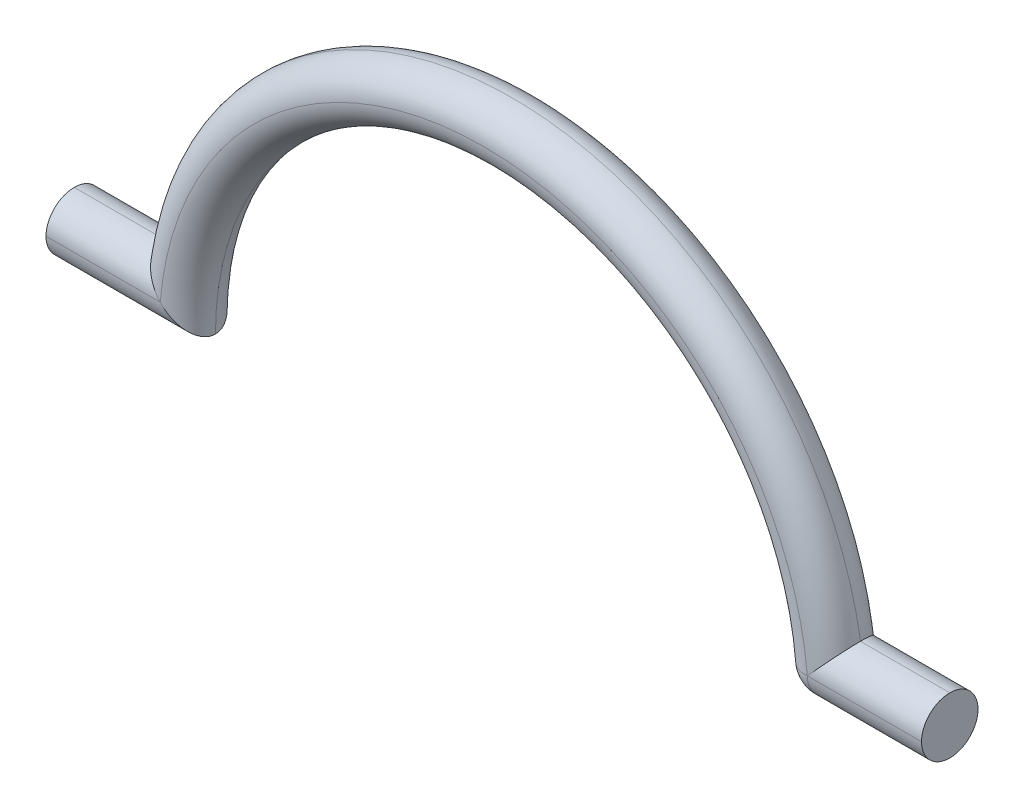
ISO-10303-21;
HEADER;
FILE_DESCRIPTION(('STEP AP214'),'2;1');
FILE_NAME('part.step','',(''),(''),'','','');
FILE_SCHEMA(('AUTOMOTIVE_DESIGN { 1 0 10303 214 1 1 1 1 }'));
ENDSEC;
DATA;
#1=APPLICATION_CONTEXT('core data for automotive mechanical design processes');
#2=APPLICATION_PROTOCOL_DEFINITION('international standard','automotive_design',2000,#1);
#3=PRODUCT_CONTEXT('',#1,'mechanical');
#4=PRODUCT('Part','Part','',(#3));
#5=PRODUCT_RELATED_PRODUCT_CATEGORY('part','',(#4));
#6=PRODUCT_DEFINITION_FORMATION('','',#4);
#7=PRODUCT_DEFINITION_CONTEXT('part definition',#1,'design');
#8=PRODUCT_DEFINITION('design','',#6,#7);
#9=PRODUCT_DEFINITION_SHAPE('','',#8);
#10=(LENGTH_UNIT() NAMED_UNIT(*) SI_UNIT(.MILLI.,.METRE.));
#11=(NAMED_UNIT(*) PLANE_ANGLE_UNIT() SI_UNIT($,.RADIAN.));
#12=(NAMED_UNIT(*) SI_UNIT($,.STERADIAN.) SOLID_ANGLE_UNIT());
#13=UNCERTAINTY_MEASURE_WITH_UNIT(LENGTH_MEASURE(1.E-05),#10,'distance_accuracy_value','');
#14=(GEOMETRIC_REPRESENTATION_CONTEXT(3) GLOBAL_UNCERTAINTY_ASSIGNED_CONTEXT((#13)) GLOBAL_UNIT_ASSIGNED_CONTEXT((#10,
#11,#12)) REPRESENTATION_CONTEXT('',''));
#15=CARTESIAN_POINT('',(0.,0.,0.));
#16=DIRECTION('',(0.,0.,1.));
#17=DIRECTION('',(1.,0.,0.));
#18=AXIS2_PLACEMENT_3D('',#15,#16,#17);
#19=CARTESIAN_POINT('',(15.5,0.,2.));
#20=DIRECTION('',(-1.,0.,0.));
#21=DIRECTION('',(0.,0.,1.));
#22=AXIS2_PLACEMENT_3D('',#19,#20,#21);
#23=PLANE('',#22);
#24=CARTESIAN_POINT('',(15.5,1.,1.));
#25=DIRECTION('',(-1.,0.,0.));
#26=DIRECTION('',(0.,0.,1.));
#27=AXIS2_PLACEMENT_3D('',#24,#25,#26);
#28=CIRCLE('',#27,1.);
#29=CARTESIAN_POINT('',(15.5,1.,2.));
#30=VERTEX_POINT('',#29);
#31=CARTESIAN_POINT('',(15.5,0.,1.));
#32=VERTEX_POINT('',#31);
#33=EDGE_CURVE('E209',#30,#32,#28,.F.);
#34=ORIENTED_EDGE('',*,*,#33,.T.);
#35=CARTESIAN_POINT('',(15.5,1.,1.));
#36=DIRECTION('',(-1.,0.,0.));
#37=DIRECTION('',(0.,0.,1.));
#38=AXIS2_PLACEMENT_3D('',#35,#36,#37);
#39=CIRCLE('',#38,1.);
#40=CARTESIAN_POINT('',(15.5,0.999999999999999,0.));
#41=VERTEX_POINT('',#40);
#42=EDGE_CURVE('E11',#32,#41,#39,.F.);
#43=ORIENTED_EDGE('',*,*,#42,.T.);
#44=CARTESIAN_POINT('',(15.5,0.999999999999999,1.));
#45=DIRECTION('',(-1.,0.,0.));
#46=DIRECTION('',(0.,0.,1.));
#47=AXIS2_PLACEMENT_3D('',#44,#45,#46);
#48=CIRCLE('',#47,1.);
#49=CARTESIAN_POINT('',(15.5,2.,1.));
#50=VERTEX_POINT('',#49);
#51=EDGE_CURVE('E218',#41,#50,#48,.F.);
#52=ORIENTED_EDGE('',*,*,#51,.T.);
#53=CARTESIAN_POINT('',(15.5,0.999999999999999,1.));
#54=DIRECTION('',(-1.,0.,0.));
#55=DIRECTION('',(0.,0.,1.));
#56=AXIS2_PLACEMENT_3D('',#53,#54,#55);
#57=CIRCLE('',#56,1.);
#58=EDGE_CURVE('E181',#50,#30,#57,.F.);
#59=ORIENTED_EDGE('',*,*,#58,.T.);
#60=EDGE_LOOP('',(#34,#43,#52,#59));
#61=FACE_BOUND('',#60,.T.);
#62=ADVANCED_FACE('F42',(#61),#23,.F.);
#63=CARTESIAN_POINT('',(-15.5,0.,2.));
#64=DIRECTION('',(1.,0.,0.));
#65=DIRECTION('',(0.,0.,-1.));
#66=AXIS2_PLACEMENT_3D('',#63,#64,#65);
#67=PLANE('',#66);
#68=CARTESIAN_POINT('',(-15.5,0.999999999999998,1.));
#69=DIRECTION('',(1.,0.,0.));
#70=DIRECTION('',(0.,0.,-1.));
#71=AXIS2_PLACEMENT_3D('',#68,#69,#70);
#72=CIRCLE('',#71,1.);
#73=CARTESIAN_POINT('',(-15.5,1.,0.));
#74=VERTEX_POINT('',#73);
#75=CARTESIAN_POINT('',(-15.5,0.,1.));
#76=VERTEX_POINT('',#75);
#77=EDGE_CURVE('E119',#74,#76,#72,.F.);
#78=ORIENTED_EDGE('',*,*,#77,.T.);
#79=CARTESIAN_POINT('',(-15.5,0.999999999999998,1.));
#80=DIRECTION('',(1.,0.,0.));
#81=DIRECTION('',(0.,0.,-1.));
#82=AXIS2_PLACEMENT_3D('',#79,#80,#81);
#83=CIRCLE('',#82,1.);
#84=CARTESIAN_POINT('',(-15.5,1.,2.));
#85=VERTEX_POINT('',#84);
#86=EDGE_CURVE('E113',#76,#85,#83,.F.);
#87=ORIENTED_EDGE('',*,*,#86,.T.);
#88=CARTESIAN_POINT('',(-15.5,1.,1.));
#89=DIRECTION('',(1.,0.,0.));
#90=DIRECTION('',(0.,0.,-1.));
#91=AXIS2_PLACEMENT_3D('',#88,#89,#90);
#92=CIRCLE('',#91,1.);
#93=CARTESIAN_POINT('',(-15.5,2.,1.));
#94=VERTEX_POINT('',#93);
#95=EDGE_CURVE('E116',#85,#94,#92,.F.);
#96=ORIENTED_EDGE('',*,*,#95,.T.);
#97=CARTESIAN_POINT('',(-15.5,1.,1.));
#98=DIRECTION('',(1.,0.,0.));
#99=DIRECTION('',(0.,0.,-1.));
#100=AXIS2_PLACEMENT_3D('',#97,#98,#99);
#101=CIRCLE('',#100,1.);
#102=EDGE_CURVE('E223',#94,#74,#101,.F.);
#103=ORIENTED_EDGE('',*,*,#102,.T.);
#104=EDGE_LOOP('',(#78,#87,#96,#103));
#105=FACE_BOUND('',#104,.T.);
#106=ADVANCED_FACE('F115',(#105),#67,.F.);
#107=CARTESIAN_POINT('',(0.,0.999999999999997,1.));
#108=DIRECTION('',(1.,0.,0.));
#109=DIRECTION('',(0.,1.,0.));
#110=AXIS2_PLACEMENT_3D('',#107,#108,#109);
#111=CYLINDRICAL_SURFACE('',#110,1.);
#112=ORIENTED_EDGE('',*,*,#95,.F.);
#113=DIRECTION('',(-1.,0.,0.));
#114=VECTOR('',#113,1.);
#115=CARTESIAN_POINT('',(-15.5,1.,2.));
#116=LINE('',#115,#114);
#117=CARTESIAN_POINT('',(-11.4564392373896,0.999999999999999,2.));
#118=VERTEX_POINT('',#117);
#119=EDGE_CURVE('E130',#118,#85,#116,.T.);
#120=ORIENTED_EDGE('',*,*,#119,.F.);
#121=CARTESIAN_POINT('',(-12.3389626792531,2.,1.));
#122=CARTESIAN_POINT('',(-12.3389646351975,2.0000025284695,1.02337388491235));
#123=CARTESIAN_POINT('',(-12.3382647375702,1.99917980040269,1.04673437253085));
#124=CARTESIAN_POINT('',(-12.3354865951296,1.99591555259792,1.09324610211119));
#125=CARTESIAN_POINT('',(-12.3334091534739,1.99347497612394,1.11639745803661));
#126=CARTESIAN_POINT('',(-12.3251899947964,1.98382271804957,1.18494902878899));
#127=CARTESIAN_POINT('',(-12.3170605383304,1.97427938785814,1.22981439000783));
#128=CARTESIAN_POINT('',(-12.2960190988534,1.94961797445727,1.31664596908342));
#129=CARTESIAN_POINT('',(-12.2831163406165,1.93451064435613,1.35861759490206));
#130=CARTESIAN_POINT('',(-12.2531944953151,1.89955005652493,1.4390172568087));
#131=CARTESIAN_POINT('',(-12.2361681921303,1.87968847967599,1.47743891587613));
#132=CARTESIAN_POINT('',(-12.1925600055079,1.82894784449291,1.56215484659433));
#133=CARTESIAN_POINT('',(-12.1646760021647,1.7965922796443,1.60689399893066));
#134=CARTESIAN_POINT('',(-12.1043945773746,1.72692645312189,1.68882614943616));
#135=CARTESIAN_POINT('',(-12.0719898117975,1.68960813399584,1.72600662179481));
#136=CARTESIAN_POINT('',(-11.9933776784451,1.59948250258567,1.80320733304777));
#137=CARTESIAN_POINT('',(-11.9459912790239,1.54544246113355,1.84058124905794));
#138=CARTESIAN_POINT('',(-11.8475307157728,1.43388346455975,1.90324234998775));
#139=CARTESIAN_POINT('',(-11.7964529369449,1.37636110837564,1.92851749669816));
#140=CARTESIAN_POINT('',(-11.6982151151231,1.26648151950925,1.96536904140237));
#141=CARTESIAN_POINT('',(-11.6513027828114,1.21431449970496,1.97820881508069));
#142=CARTESIAN_POINT('',(-11.5565411963398,1.10959078933064,1.9953882519191));
#143=CARTESIAN_POINT('',(-11.5086939586068,1.05703506283623,1.99974452477709));
#144=CARTESIAN_POINT('',(-11.4592933163264,1.0031143447076,1.99999636116849));
#145=CARTESIAN_POINT('',(-11.4578663277403,1.00155708147522,1.99999999777978));
#146=CARTESIAN_POINT('',(-11.4564392373896,0.999999999999999,2.));
#147=B_SPLINE_CURVE_WITH_KNOTS('',3,(#121,#122,#123,#124,#125,#126,#127,#128,#129,#130,#131,
#132,#133,#134,#135,#136,#137,#138,#139,#140,#141,#142,#143,#144,#145,#146),.UNSPECIFIED.,.F.,
.F.,(4,2,2,2,2,2,2,2,2,2,2,2,4),(0.,0.0700710735051621,0.140101328936832,0.279075258052492,
0.417782000541511,0.556733253595767,0.74129081120055,0.92615175779909,1.16789347977333,
1.40987523602553,1.62333896969062,1.83638434458721,1.84272092183685),.UNSPECIFIED.);
#148=CARTESIAN_POINT('',(-12.3389626792531,2.,1.));
#149=VERTEX_POINT('',#148);
#150=EDGE_CURVE('E142',#149,#118,#147,.T.);
#151=ORIENTED_EDGE('',*,*,#150,.F.);
#152=DIRECTION('',(-1.,0.,0.));
#153=VECTOR('',#152,1.);
#154=CARTESIAN_POINT('',(-12.3389626792531,2.,1.));
#155=LINE('',#154,#153);
#156=EDGE_CURVE('E133',#94,#149,#155,.F.);
#157=ORIENTED_EDGE('',*,*,#156,.F.);
#158=EDGE_LOOP('',(#112,#120,#151,#157));
#159=FACE_BOUND('',#158,.T.);
#160=ADVANCED_FACE('F128',(#159),#111,.T.);
#161=CARTESIAN_POINT('',(0.,0.,1.));
#162=DIRECTION('',(0.,0.,1.));
#163=DIRECTION('',(1.,0.,0.));
#164=AXIS2_PLACEMENT_3D('',#161,#162,#163);
#165=TOROIDAL_SURFACE('',#164,11.5,1.);
#166=CARTESIAN_POINT('',(0.,0.,2.));
#167=DIRECTION('',(0.,0.,1.));
#168=DIRECTION('',(1.,0.,0.));
#169=AXIS2_PLACEMENT_3D('',#166,#167,#168);
#170=CIRCLE('',#169,11.5);
#171=CARTESIAN_POINT('',(11.4564392373896,0.999999999999999,2.));
#172=VERTEX_POINT('',#171);
#173=EDGE_CURVE('E141',#172,#118,#170,.T.);
#174=ORIENTED_EDGE('',*,*,#173,.F.);
#175=CARTESIAN_POINT('',(12.3389626792531,2.,1.));
#176=CARTESIAN_POINT('',(12.3389646351975,2.0000025284695,1.02337388491235));
#177=CARTESIAN_POINT('',(12.3382647375702,1.99917980040269,1.04673437253085));
#178=CARTESIAN_POINT('',(12.3354865951296,1.99591555259792,1.09324610211119));
#179=CARTESIAN_POINT('',(12.3334091534739,1.99347497612394,1.11639745803661));
#180=CARTESIAN_POINT('',(12.3251899947964,1.98382271804957,1.18494902878899));
#181=CARTESIAN_POINT('',(12.3170605383304,1.97427938785814,1.22981439000783));
#182=CARTESIAN_POINT('',(12.2960190988534,1.94961797445727,1.31664596908342));
#183=CARTESIAN_POINT('',(12.2831163406165,1.93451064435613,1.35861759490206));
#184=CARTESIAN_POINT('',(12.2531944953151,1.89955005652493,1.4390172568087));
#185=CARTESIAN_POINT('',(12.2361681921303,1.87968847967599,1.47743891587613));
#186=CARTESIAN_POINT('',(12.1925600055079,1.82894784449291,1.56215484659433));
#187=CARTESIAN_POINT('',(12.1646760021647,1.7965922796443,1.60689399893066));
#188=CARTESIAN_POINT('',(12.1043945773746,1.72692645312189,1.68882614943616));
#189=CARTESIAN_POINT('',(12.0719898117975,1.68960813399584,1.72600662179481));
#190=CARTESIAN_POINT('',(11.9933776784451,1.59948250258567,1.80320733304777));
#191=CARTESIAN_POINT('',(11.9459912790239,1.54544246113355,1.84058124905794));
#192=CARTESIAN_POINT('',(11.8475307157728,1.43388346455975,1.90324234998775));
#193=CARTESIAN_POINT('',(11.7964529369449,1.37636110837564,1.92851749669816));
#194=CARTESIAN_POINT('',(11.6982151151231,1.26648151950925,1.96536904140237));
#195=CARTESIAN_POINT('',(11.6513027828114,1.21431449970496,1.97820881508069));
#196=CARTESIAN_POINT('',(11.5565411963398,1.10959078933064,1.9953882519191));
#197=CARTESIAN_POINT('',(11.5086939586068,1.05703506283623,1.99974452477709));
#198=CARTESIAN_POINT('',(11.4592933163264,1.0031143447076,1.99999636116849));
#199=CARTESIAN_POINT('',(11.4578663277403,1.00155708147522,1.99999999777978));
#200=CARTESIAN_POINT('',(11.4564392373896,0.999999999999999,2.));
#201=B_SPLINE_CURVE_WITH_KNOTS('',3,(#175,#176,#177,#178,#179,#180,#181,#182,#183,#184,#185,
#186,#187,#188,#189,#190,#191,#192,#193,#194,#195,#196,#197,#198,#199,#200),.UNSPECIFIED.,.F.,
.F.,(4,2,2,2,2,2,2,2,2,2,2,2,4),(0.,0.0700710735051621,0.140101328936832,0.279075258052492,
0.417782000541511,0.556733253595767,0.74129081120055,0.92615175779909,1.16789347977334,
1.40987523602553,1.62333896969062,1.83638434458721,1.84272092183685),.UNSPECIFIED.);
#202=CARTESIAN_POINT('',(12.3389626792531,2.,1.));
#203=VERTEX_POINT('',#202);
#204=EDGE_CURVE('E172',#172,#203,#201,.F.);
#205=ORIENTED_EDGE('',*,*,#204,.T.);
#206=CARTESIAN_POINT('',(0.,0.,1.));
#207=DIRECTION('',(0.,0.,1.));
#208=DIRECTION('',(1.,0.,0.));
#209=AXIS2_PLACEMENT_3D('',#206,#207,#208);
#210=CIRCLE('',#209,12.5);
#211=EDGE_CURVE('E135',#149,#203,#210,.F.);
#212=ORIENTED_EDGE('',*,*,#211,.F.);
#213=ORIENTED_EDGE('',*,*,#150,.T.);
#214=EDGE_LOOP('',(#174,#205,#212,#213));
#215=FACE_BOUND('',#214,.T.);
#216=ADVANCED_FACE('F161',(#215),#165,.T.);
#217=CARTESIAN_POINT('',(15.5,0.999999999999999,1.));
#218=DIRECTION('',(-1.,0.,0.));
#219=DIRECTION('',(0.,0.,1.));
#220=AXIS2_PLACEMENT_3D('',#217,#218,#219);
#221=CYLINDRICAL_SURFACE('',#220,1.);
#222=ORIENTED_EDGE('',*,*,#51,.F.);
#223=DIRECTION('',(-1.,0.,0.));
#224=VECTOR('',#223,1.);
#225=CARTESIAN_POINT('',(0.,0.999999999999999,0.));
#226=LINE('',#225,#224);
#227=CARTESIAN_POINT('',(11.4564392373896,0.999999999999999,0.));
#228=VERTEX_POINT('',#227);
#229=EDGE_CURVE('E124',#228,#41,#226,.F.);
#230=ORIENTED_EDGE('',*,*,#229,.F.);
#231=CARTESIAN_POINT('',(12.3389626792531,2.,1.));
#232=CARTESIAN_POINT('',(12.3389646351975,2.0000025284695,0.976626115087649));
#233=CARTESIAN_POINT('',(12.3382647375702,1.99917980040269,0.95326562746915));
#234=CARTESIAN_POINT('',(12.3354865951296,1.99591555259792,0.906753897888809));
#235=CARTESIAN_POINT('',(12.3334091534739,1.99347497612394,0.883602541963386));
#236=CARTESIAN_POINT('',(12.3251899947964,1.98382271804957,0.81505097121101));
#237=CARTESIAN_POINT('',(12.3170605383304,1.97427938785814,0.770185609992169));
#238=CARTESIAN_POINT('',(12.2960190988534,1.94961797445727,0.683354030916584));
#239=CARTESIAN_POINT('',(12.2831163406165,1.93451064435613,0.641382405097939));
#240=CARTESIAN_POINT('',(12.2531944953151,1.89955005652493,0.560982743191299));
#241=CARTESIAN_POINT('',(12.2361681921303,1.87968847967599,0.522561084123867));
#242=CARTESIAN_POINT('',(12.1925600055079,1.82894784449291,0.43784515340567));
#243=CARTESIAN_POINT('',(12.1646760021647,1.7965922796443,0.39310600106934));
#244=CARTESIAN_POINT('',(12.1043945773746,1.72692645312189,0.311173850563844));
#245=CARTESIAN_POINT('',(12.0719898117975,1.68960813399584,0.273993378205194));
#246=CARTESIAN_POINT('',(11.9933776784451,1.59948250258567,0.19679266695223));
#247=CARTESIAN_POINT('',(11.9459912790239,1.54544246113355,0.15941875094206));
#248=CARTESIAN_POINT('',(11.8475307157728,1.43388346455975,0.0967576500122516));
#249=CARTESIAN_POINT('',(11.7964529369449,1.37636110837564,0.0714825033018401));
#250=CARTESIAN_POINT('',(11.6982151151231,1.26648151950925,0.0346309585976325));
#251=CARTESIAN_POINT('',(11.6513027828114,1.21431449970495,0.0217911849193081));
#252=CARTESIAN_POINT('',(11.5565411963398,1.10959078933065,0.00461174808089598));
#253=CARTESIAN_POINT('',(11.5086939586068,1.05703506283624,0.000255475222908989));
#254=CARTESIAN_POINT('',(11.4592933163264,1.0031143447076,3.6388315121597E-06));
#255=CARTESIAN_POINT('',(11.4578663277403,1.00155708147522,2.22022127127157E-09));
#256=CARTESIAN_POINT('',(11.4564392373896,0.999999999999999,0.));
#257=B_SPLINE_CURVE_WITH_KNOTS('',3,(#231,#232,#233,#234,#235,#236,#237,#238,#239,#240,#241,
#242,#243,#244,#245,#246,#247,#248,#249,#250,#251,#252,#253,#254,#255,#256),.UNSPECIFIED.,.F.,
.F.,(4,2,2,2,2,2,2,2,2,2,2,2,4),(0.,0.0700710735051621,0.140101328936832,0.279075258052492,
0.417782000541511,0.556733253595767,0.741290811200551,0.926151757799091,1.16789347977334,
1.40987523602553,1.62333896969062,1.83638434458721,1.84272092183685),.UNSPECIFIED.);
#258=EDGE_CURVE('E145',#203,#228,#257,.T.);
#259=ORIENTED_EDGE('',*,*,#258,.F.);
#260=DIRECTION('',(-1.,0.,0.));
#261=VECTOR('',#260,1.);
#262=CARTESIAN_POINT('',(15.5,2.,1.));
#263=LINE('',#262,#261);
#264=EDGE_CURVE('E229',#50,#203,#263,.T.);
#265=ORIENTED_EDGE('',*,*,#264,.F.);
#266=EDGE_LOOP('',(#222,#230,#259,#265));
#267=FACE_BOUND('',#266,.T.);
#268=ADVANCED_FACE('F165',(#267),#221,.T.);
#269=CARTESIAN_POINT('',(-15.5,1.,1.));
#270=DIRECTION('',(-1.,0.,0.));
#271=DIRECTION('',(0.,-1.,0.));
#272=AXIS2_PLACEMENT_3D('',#269,#270,#271);
#273=CYLINDRICAL_SURFACE('',#272,1.);
#274=ORIENTED_EDGE('',*,*,#102,.F.);
#275=ORIENTED_EDGE('',*,*,#156,.T.);
#276=CARTESIAN_POINT('',(-12.3389626792531,2.,1.));
#277=CARTESIAN_POINT('',(-12.3389646351975,2.0000025284695,0.97662611508765));
#278=CARTESIAN_POINT('',(-12.3382647375702,1.99917980040269,0.95326562746915));
#279=CARTESIAN_POINT('',(-12.3354865951296,1.99591555259792,0.906753897888809));
#280=CARTESIAN_POINT('',(-12.3334091534739,1.99347497612394,0.883602541963386));
#281=CARTESIAN_POINT('',(-12.3251899947964,1.98382271804957,0.81505097121101));
#282=CARTESIAN_POINT('',(-12.3170605383304,1.97427938785814,0.770185609992169));
#283=CARTESIAN_POINT('',(-12.2960190988534,1.94961797445727,0.683354030916584));
#284=CARTESIAN_POINT('',(-12.2831163406165,1.93451064435613,0.641382405097939));
#285=CARTESIAN_POINT('',(-12.2531944953151,1.89955005652493,0.560982743191299));
#286=CARTESIAN_POINT('',(-12.2361681921303,1.87968847967599,0.522561084123867));
#287=CARTESIAN_POINT('',(-12.1925600055079,1.82894784449291,0.43784515340567));
#288=CARTESIAN_POINT('',(-12.1646760021647,1.7965922796443,0.393106001069341));
#289=CARTESIAN_POINT('',(-12.1043945773746,1.72692645312189,0.311173850563844));
#290=CARTESIAN_POINT('',(-12.0719898117975,1.68960813399584,0.273993378205194));
#291=CARTESIAN_POINT('',(-11.9933776784451,1.59948250258567,0.19679266695223));
#292=CARTESIAN_POINT('',(-11.9459912790239,1.54544246113355,0.15941875094206));
#293=CARTESIAN_POINT('',(-11.8475307157728,1.43388346455975,0.0967576500122516));
#294=CARTESIAN_POINT('',(-11.7964529369449,1.37636110837564,0.0714825033018399));
#295=CARTESIAN_POINT('',(-11.6982151151231,1.26648151950925,0.0346309585976325));
#296=CARTESIAN_POINT('',(-11.6513027828114,1.21431449970495,0.0217911849193084));
#297=CARTESIAN_POINT('',(-11.5565411963398,1.10959078933065,0.00461174808089564));
#298=CARTESIAN_POINT('',(-11.5086939586068,1.05703506283624,0.000255475222907734));
#299=CARTESIAN_POINT('',(-11.4592933163264,1.0031143447076,3.63883151208555E-06));
#300=CARTESIAN_POINT('',(-11.4578663277403,1.00155708147522,2.22022123306401E-09));
#301=CARTESIAN_POINT('',(-11.4564392373896,0.999999999999999,0.));
#302=B_SPLINE_CURVE_WITH_KNOTS('',3,(#276,#277,#278,#279,#280,#281,#282,#283,#284,#285,#286,
#287,#288,#289,#290,#291,#292,#293,#294,#295,#296,#297,#298,#299,#300,#301),.UNSPECIFIED.,.F.,
.F.,(4,2,2,2,2,2,2,2,2,2,2,2,4),(0.,0.0700710735051619,0.140101328936831,0.279075258052492,
0.417782000541511,0.556733253595767,0.741290811200551,0.926151757799091,1.16789347977334,
1.40987523602553,1.62333896969062,1.83638434458721,1.84272092183685),.UNSPECIFIED.);
#303=CARTESIAN_POINT('',(-11.4564392373896,1.,0.));
#304=VERTEX_POINT('',#303);
#305=EDGE_CURVE('E267',#304,#149,#302,.F.);
#306=ORIENTED_EDGE('',*,*,#305,.F.);
#307=DIRECTION('',(-1.,0.,0.));
#308=VECTOR('',#307,1.);
#309=CARTESIAN_POINT('',(0.,0.999999999999997,0.));
#310=LINE('',#309,#308);
#311=EDGE_CURVE('E264',#74,#304,#310,.F.);
#312=ORIENTED_EDGE('',*,*,#311,.F.);
#313=EDGE_LOOP('',(#274,#275,#306,#312));
#314=FACE_BOUND('',#313,.T.);
#315=ADVANCED_FACE('F279',(#314),#273,.T.);
#316=CARTESIAN_POINT('',(0.,0.,1.));
#317=DIRECTION('',(0.,0.,1.));
#318=DIRECTION('',(1.,0.,0.));
#319=AXIS2_PLACEMENT_3D('',#316,#317,#318);
#320=TOROIDAL_SURFACE('',#319,11.5,1.);
#321=ORIENTED_EDGE('',*,*,#211,.T.);
#322=ORIENTED_EDGE('',*,*,#258,.T.);
#323=CARTESIAN_POINT('',(0.,0.,0.));
#324=DIRECTION('',(0.,0.,1.));
#325=DIRECTION('',(1.,0.,0.));
#326=AXIS2_PLACEMENT_3D('',#323,#324,#325);
#327=CIRCLE('',#326,11.5);
#328=EDGE_CURVE('E261',#304,#228,#327,.F.);
#329=ORIENTED_EDGE('',*,*,#328,.F.);
#330=ORIENTED_EDGE('',*,*,#305,.T.);
#331=EDGE_LOOP('',(#321,#322,#329,#330));
#332=FACE_BOUND('',#331,.T.);
#333=ADVANCED_FACE('F277',(#332),#320,.T.);
#334=CARTESIAN_POINT('',(-12.5,1.,1.));
#335=DIRECTION('',(1.,0.,0.));
#336=DIRECTION('',(0.,1.,0.));
#337=AXIS2_PLACEMENT_3D('',#334,#335,#336);
#338=CYLINDRICAL_SURFACE('',#337,1.);
#339=ORIENTED_EDGE('',*,*,#77,.F.);
#340=ORIENTED_EDGE('',*,*,#311,.T.);
#341=CARTESIAN_POINT('',(-10.5,0.,1.));
#342=CARTESIAN_POINT('',(-10.4999966251875,-3.09805134946097E-06,0.977476641487929));
#343=CARTESIAN_POINT('',(-10.5007616337562,0.000761611478248969,0.954967355052061));
#344=CARTESIAN_POINT('',(-10.5037900687932,0.00379058430058446,0.910169520141627));
#345=CARTESIAN_POINT('',(-10.5060522633737,0.00605361477244956,0.887880805469902));
#346=CARTESIAN_POINT('',(-10.5149714128456,0.0149803472524174,0.822004544065736));
#347=CARTESIAN_POINT('',(-10.5237625921313,0.0237832669098118,0.778966184757168));
#348=CARTESIAN_POINT('',(-10.5463155464968,0.0464117985571344,0.695816821252204));
#349=CARTESIAN_POINT('',(-10.5600628087057,0.0602227462460586,0.655697676770269));
#350=CARTESIAN_POINT('',(-10.5916746213004,0.0920628788587359,0.578827561237774));
#351=CARTESIAN_POINT('',(-10.6095488437016,0.110101974472279,0.542084790428191));
#352=CARTESIAN_POINT('',(-10.6567023448318,0.157835579617516,0.457795155172658));
#353=CARTESIAN_POINT('',(-10.6876270206254,0.189251292070749,0.412145604975437));
#354=CARTESIAN_POINT('',(-10.7540222174955,0.257042088871547,0.32849115026691));
#355=CARTESIAN_POINT('',(-10.7895014629401,0.293426700009744,0.290501286732973));
#356=CARTESIAN_POINT('',(-10.8770057850152,0.38365336579911,0.209421770693262));
#357=CARTESIAN_POINT('',(-10.9303608412776,0.439037046356,0.169489446275423));
#358=CARTESIAN_POINT('',(-11.0403290206573,0.554087070719489,0.102447774931218));
#359=CARTESIAN_POINT('',(-11.0969450466829,0.613757242405059,0.0753500575792918));
#360=CARTESIAN_POINT('',(-11.2033882874256,0.726833213714089,0.036458201045762));
#361=CARTESIAN_POINT('',(-11.2530027880108,0.779885057702854,0.023009596121505));
#362=CARTESIAN_POINT('',(-11.3525364914352,0.887029372947291,0.00492193933897861));
#363=CARTESIAN_POINT('',(-11.4024548114394,0.941119365585309,0.000264036448740415));
#364=CARTESIAN_POINT('',(-11.4535848685397,0.996885917424114,3.63928672555727E-06));
#365=CARTESIAN_POINT('',(-11.4550121469137,0.998442914760006,2.6970561986095E-09));
#366=CARTESIAN_POINT('',(-11.4564392373896,1.,0.));
#367=B_SPLINE_CURVE_WITH_KNOTS('',3,(#341,#342,#343,#344,#345,#346,#347,#348,#349,#350,#351,
#352,#353,#354,#355,#356,#357,#358,#359,#360,#361,#362,#363,#364,#365,#366),.UNSPECIFIED.,.F.,
.F.,(4,2,2,2,2,2,2,2,2,2,2,2,4),(0.,0.0675175770028362,0.134979669359281,0.268602676514723,
0.401837532754599,0.535387868211426,0.724719171076182,0.914418709967148,1.17300166628852,
1.43181848125317,1.65292645409007,1.87355973553753,1.87989631278078),.UNSPECIFIED.);
#368=CARTESIAN_POINT('',(-10.5,0.,1.));
#369=VERTEX_POINT('',#368);
#370=EDGE_CURVE('E254',#369,#304,#367,.T.);
#371=ORIENTED_EDGE('',*,*,#370,.F.);
#372=DIRECTION('',(1.,0.,0.));
#373=VECTOR('',#372,1.);
#374=CARTESIAN_POINT('',(-12.5,0.,1.));
#375=LINE('',#374,#373);
#376=EDGE_CURVE('E262',#76,#369,#375,.T.);
#377=ORIENTED_EDGE('',*,*,#376,.F.);
#378=EDGE_LOOP('',(#339,#340,#371,#377));
#379=FACE_BOUND('',#378,.T.);
#380=ADVANCED_FACE('F250',(#379),#338,.T.);
#381=CARTESIAN_POINT('',(0.,0.,1.));
#382=DIRECTION('',(0.,0.,1.));
#383=DIRECTION('',(1.,0.,0.));
#384=AXIS2_PLACEMENT_3D('',#381,#382,#383);
#385=TOROIDAL_SURFACE('',#384,11.5,1.);
#386=ORIENTED_EDGE('',*,*,#328,.T.);
#387=CARTESIAN_POINT('',(11.4564392373896,1.,1.));
#388=DIRECTION('',(-0.0869565217391304,0.996212107599096,0.));
#389=DIRECTION('',(-0.996212107599096,-0.0869565217391304,0.));
#390=AXIS2_PLACEMENT_3D('',#387,#388,#389);
#391=CIRCLE('',#390,1.);
#392=CARTESIAN_POINT('',(10.4602271297905,0.91304347826087,1.));
#393=VERTEX_POINT('',#392);
#394=EDGE_CURVE('E51',#228,#393,#391,.T.);
#395=ORIENTED_EDGE('',*,*,#394,.T.);
#396=CARTESIAN_POINT('',(0.,0.,1.));
#397=DIRECTION('',(0.,0.,1.));
#398=DIRECTION('',(1.,0.,0.));
#399=AXIS2_PLACEMENT_3D('',#396,#397,#398);
#400=CIRCLE('',#399,10.5);
#401=EDGE_CURVE('E241',#369,#393,#400,.F.);
#402=ORIENTED_EDGE('',*,*,#401,.F.);
#403=ORIENTED_EDGE('',*,*,#370,.T.);
#404=EDGE_LOOP('',(#386,#395,#402,#403));
#405=FACE_BOUND('',#404,.T.);
#406=ADVANCED_FACE('F246',(#405),#385,.T.);
#407=CARTESIAN_POINT('',(0.,1.00000000000001,1.));
#408=DIRECTION('',(-1.,0.,0.));
#409=DIRECTION('',(0.,-1.,0.));
#410=AXIS2_PLACEMENT_3D('',#407,#408,#409);
#411=CYLINDRICAL_SURFACE('',#410,1.);
#412=ORIENTED_EDGE('',*,*,#86,.F.);
#413=ORIENTED_EDGE('',*,*,#376,.T.);
#414=CARTESIAN_POINT('',(-10.5,0.,1.));
#415=CARTESIAN_POINT('',(-10.4999966251875,-3.09805134938163E-06,1.02252335851207));
#416=CARTESIAN_POINT('',(-10.5007616337562,0.000761611478249091,1.04503264494794));
#417=CARTESIAN_POINT('',(-10.5037900687932,0.0037905843005846,1.08983047985837));
#418=CARTESIAN_POINT('',(-10.5060522633737,0.00605361477244966,1.1121191945301));
#419=CARTESIAN_POINT('',(-10.5149714128456,0.0149803472524174,1.17799545593426));
#420=CARTESIAN_POINT('',(-10.5237625921313,0.0237832669098117,1.22103381524283));
#421=CARTESIAN_POINT('',(-10.5463155464968,0.0464117985571341,1.3041831787478));
#422=CARTESIAN_POINT('',(-10.5600628087057,0.0602227462460584,1.34430232322973));
#423=CARTESIAN_POINT('',(-10.5916746213004,0.0920628788587358,1.42117243876223));
#424=CARTESIAN_POINT('',(-10.6095488437016,0.110101974472279,1.45791520957181));
#425=CARTESIAN_POINT('',(-10.6567023448318,0.157835579617515,1.54220484482734));
#426=CARTESIAN_POINT('',(-10.6876270206254,0.189251292070748,1.58785439502456));
#427=CARTESIAN_POINT('',(-10.7540222174955,0.257042088871546,1.67150884973309));
#428=CARTESIAN_POINT('',(-10.7895014629401,0.293426700009743,1.70949871326703));
#429=CARTESIAN_POINT('',(-10.8770057850152,0.383653365799109,1.79057822930674));
#430=CARTESIAN_POINT('',(-10.9303608412776,0.439037046356,1.83051055372458));
#431=CARTESIAN_POINT('',(-11.0403290206573,0.554087070719485,1.89755222506878));
#432=CARTESIAN_POINT('',(-11.0969450466829,0.613757242405051,1.92464994242071));
#433=CARTESIAN_POINT('',(-11.2033882874256,0.726833213714094,1.96354179895424));
#434=CARTESIAN_POINT('',(-11.2530027880108,0.779885057702874,1.9769904038785));
#435=CARTESIAN_POINT('',(-11.3525364914352,0.887029372947269,1.99507806066102));
#436=CARTESIAN_POINT('',(-11.4024548114395,0.941119365585231,1.99973596355126));
#437=CARTESIAN_POINT('',(-11.4535848685397,0.99688591742411,1.99999636071327));
#438=CARTESIAN_POINT('',(-11.4550121469137,0.998442914760004,1.99999999730294));
#439=CARTESIAN_POINT('',(-11.4564392373896,1.,2.));
#440=B_SPLINE_CURVE_WITH_KNOTS('',3,(#414,#415,#416,#417,#418,#419,#420,#421,#422,#423,#424,
#425,#426,#427,#428,#429,#430,#431,#432,#433,#434,#435,#436,#437,#438,#439),.UNSPECIFIED.,.F.,
.F.,(4,2,2,2,2,2,2,2,2,2,2,2,4),(0.,0.0675175770028362,0.13497966935928,0.268602676514723,
0.401837532754599,0.535387868211425,0.72471917107618,0.914418709967146,1.17300166628851,
1.43181848125317,1.65292645409007,1.87355973553753,1.87989631278078),.UNSPECIFIED.);
#441=EDGE_CURVE('E139',#118,#369,#440,.F.);
#442=ORIENTED_EDGE('',*,*,#441,.F.);
#443=ORIENTED_EDGE('',*,*,#119,.T.);
#444=EDGE_LOOP('',(#412,#413,#442,#443));
#445=FACE_BOUND('',#444,.T.);
#446=ADVANCED_FACE('F137',(#445),#411,.T.);
#447=CARTESIAN_POINT('',(0.,0.,1.));
#448=DIRECTION('',(0.,0.,1.));
#449=DIRECTION('',(1.,0.,0.));
#450=AXIS2_PLACEMENT_3D('',#447,#448,#449);
#451=TOROIDAL_SURFACE('',#450,11.5,1.);
#452=ORIENTED_EDGE('',*,*,#401,.T.);
#453=CARTESIAN_POINT('',(11.4564392373896,1.,1.));
#454=DIRECTION('',(-0.0869565217391304,0.996212107599096,0.));
#455=DIRECTION('',(-0.996212107599096,-0.0869565217391304,0.));
#456=AXIS2_PLACEMENT_3D('',#453,#454,#455);
#457=CIRCLE('',#456,1.);
#458=EDGE_CURVE('E292',#393,#172,#457,.T.);
#459=ORIENTED_EDGE('',*,*,#458,.T.);
#460=ORIENTED_EDGE('',*,*,#173,.T.);
#461=ORIENTED_EDGE('',*,*,#441,.T.);
#462=EDGE_LOOP('',(#452,#459,#460,#461));
#463=FACE_BOUND('',#462,.T.);
#464=ADVANCED_FACE('F167',(#463),#451,.T.);
#465=CARTESIAN_POINT('',(0.,1.,1.));
#466=DIRECTION('',(-1.,0.,0.));
#467=DIRECTION('',(0.,0.,1.));
#468=AXIS2_PLACEMENT_3D('',#465,#466,#467);
#469=CYLINDRICAL_SURFACE('',#468,1.);
#470=DIRECTION('',(1.,0.,0.));
#471=VECTOR('',#470,1.);
#472=CARTESIAN_POINT('',(15.5,1.,2.));
#473=LINE('',#472,#471);
#474=EDGE_CURVE('E150',#172,#30,#473,.T.);
#475=ORIENTED_EDGE('',*,*,#474,.F.);
#476=CARTESIAN_POINT('',(11.4564392373896,1.,1.));
#477=DIRECTION('',(-1.,0.,0.));
#478=DIRECTION('',(0.,0.,1.));
#479=AXIS2_PLACEMENT_3D('',#476,#477,#478);
#480=CIRCLE('',#479,1.);
#481=CARTESIAN_POINT('',(11.4564392373896,0.,1.));
#482=VERTEX_POINT('',#481);
#483=EDGE_CURVE('E180',#172,#482,#480,.F.);
#484=ORIENTED_EDGE('',*,*,#483,.T.);
#485=DIRECTION('',(1.,0.,0.));
#486=VECTOR('',#485,1.);
#487=CARTESIAN_POINT('',(10.5,0.,1.));
#488=LINE('',#487,#486);
#489=EDGE_CURVE('E217',#32,#482,#488,.F.);
#490=ORIENTED_EDGE('',*,*,#489,.F.);
#491=ORIENTED_EDGE('',*,*,#33,.F.);
#492=EDGE_LOOP('',(#475,#484,#490,#491));
#493=FACE_BOUND('',#492,.T.);
#494=ADVANCED_FACE('F189',(#493),#469,.T.);
#495=CARTESIAN_POINT('',(0.,0.999999999999999,1.));
#496=DIRECTION('',(1.,0.,0.));
#497=DIRECTION('',(0.,0.,-1.));
#498=AXIS2_PLACEMENT_3D('',#495,#496,#497);
#499=CYLINDRICAL_SURFACE('',#498,1.);
#500=ORIENTED_EDGE('',*,*,#58,.F.);
#501=ORIENTED_EDGE('',*,*,#264,.T.);
#502=ORIENTED_EDGE('',*,*,#204,.F.);
#503=ORIENTED_EDGE('',*,*,#474,.T.);
#504=EDGE_LOOP('',(#500,#501,#502,#503));
#505=FACE_BOUND('',#504,.T.);
#506=ADVANCED_FACE('F184',(#505),#499,.T.);
#507=CARTESIAN_POINT('',(12.5,1.,1.));
#508=DIRECTION('',(1.,0.,0.));
#509=DIRECTION('',(0.,0.,-1.));
#510=AXIS2_PLACEMENT_3D('',#507,#508,#509);
#511=CYLINDRICAL_SURFACE('',#510,1.);
#512=CARTESIAN_POINT('',(11.4564392373896,1.,1.));
#513=DIRECTION('',(-1.,0.,0.));
#514=DIRECTION('',(0.,0.,1.));
#515=AXIS2_PLACEMENT_3D('',#512,#513,#514);
#516=CIRCLE('',#515,1.);
#517=EDGE_CURVE('E46',#228,#482,#516,.T.);
#518=ORIENTED_EDGE('',*,*,#517,.F.);
#519=ORIENTED_EDGE('',*,*,#229,.T.);
#520=ORIENTED_EDGE('',*,*,#42,.F.);
#521=ORIENTED_EDGE('',*,*,#489,.T.);
#522=EDGE_LOOP('',(#518,#519,#520,#521));
#523=FACE_BOUND('',#522,.T.);
#524=ADVANCED_FACE('F44',(#523),#511,.T.);
#525=CARTESIAN_POINT('',(11.4564392373896,1.,1.));
#526=DIRECTION('',(0.,1.,0.));
#527=DIRECTION('',(0.,0.,1.));
#528=AXIS2_PLACEMENT_3D('',#525,#526,#527);
#529=SPHERICAL_SURFACE('',#528,1.);
#530=ORIENTED_EDGE('',*,*,#394,.F.);
#531=ORIENTED_EDGE('',*,*,#517,.T.);
#532=CARTESIAN_POINT('',(11.4564392373896,1.,1.));
#533=DIRECTION('',(0.,0.,1.));
#534=DIRECTION('',(1.,0.,0.));
#535=AXIS2_PLACEMENT_3D('',#532,#533,#534);
#536=CIRCLE('',#535,1.);
#537=EDGE_CURVE('E66',#393,#482,#536,.T.);
#538=ORIENTED_EDGE('',*,*,#537,.F.);
#539=EDGE_LOOP('',(#530,#531,#538));
#540=FACE_BOUND('',#539,.T.);
#541=ADVANCED_FACE('F195',(#540),#529,.T.);
#542=CARTESIAN_POINT('',(11.4564392373896,1.,1.));
#543=DIRECTION('',(0.,0.,1.));
#544=DIRECTION('',(1.,0.,0.));
#545=AXIS2_PLACEMENT_3D('',#542,#543,#544);
#546=SPHERICAL_SURFACE('',#545,1.);
#547=ORIENTED_EDGE('',*,*,#483,.F.);
#548=ORIENTED_EDGE('',*,*,#458,.F.);
#549=ORIENTED_EDGE('',*,*,#537,.T.);
#550=EDGE_LOOP('',(#547,#548,#549));
#551=FACE_BOUND('',#550,.T.);
#552=ADVANCED_FACE('F193',(#551),#546,.T.);
#553=CLOSED_SHELL('',(#62,#106,#160,#216,#268,#315,#333,#380,#406,#446,#464,#494,#506,#524,#541,#552));
#554=MANIFOLD_SOLID_BREP('B2',#553);
#555=ADVANCED_BREP_SHAPE_REPRESENTATION('',(#18,#554),#14);
#556=SHAPE_DEFINITION_REPRESENTATION(#9,#555);
ENDSEC;
END-ISO-10303-21;
